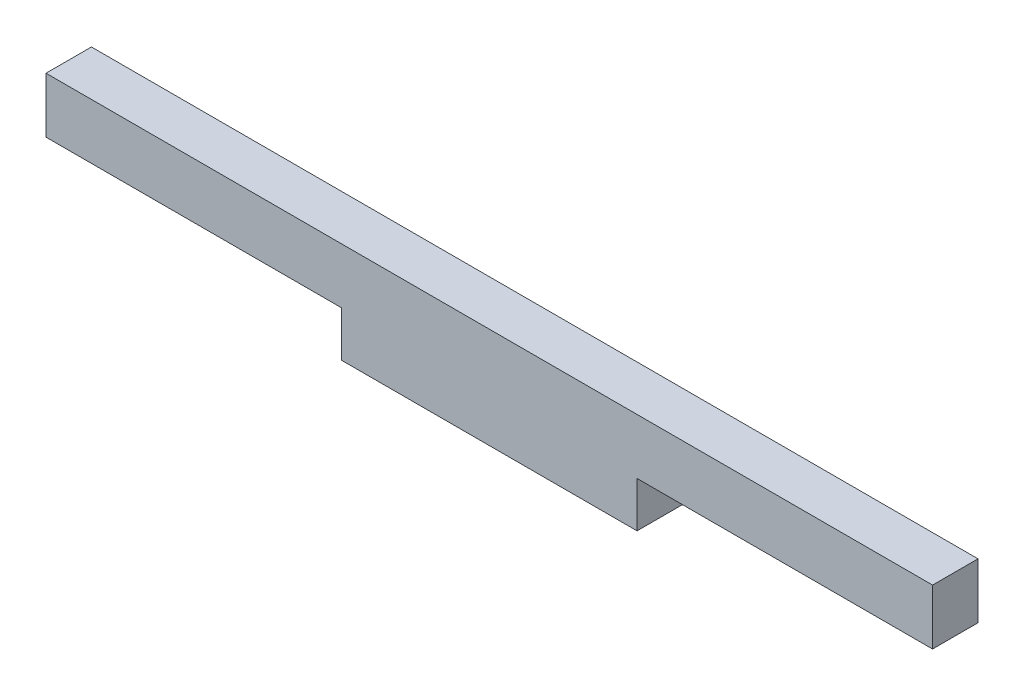
ISO-10303-21;
HEADER;
FILE_DESCRIPTION(('STEP AP214'),'2;1');
FILE_NAME('part.step','',(''),(''),'','','');
FILE_SCHEMA(('AUTOMOTIVE_DESIGN { 1 0 10303 214 1 1 1 1 }'));
ENDSEC;
DATA;
#1=APPLICATION_CONTEXT('core data for automotive mechanical design processes');
#2=APPLICATION_PROTOCOL_DEFINITION('international standard','automotive_design',2000,#1);
#3=PRODUCT_CONTEXT('',#1,'mechanical');
#4=PRODUCT('Part','Part','',(#3));
#5=PRODUCT_RELATED_PRODUCT_CATEGORY('part','',(#4));
#6=PRODUCT_DEFINITION_FORMATION('','',#4);
#7=PRODUCT_DEFINITION_CONTEXT('part definition',#1,'design');
#8=PRODUCT_DEFINITION('design','',#6,#7);
#9=PRODUCT_DEFINITION_SHAPE('','',#8);
#10=(LENGTH_UNIT() NAMED_UNIT(*) SI_UNIT(.MILLI.,.METRE.));
#11=(NAMED_UNIT(*) PLANE_ANGLE_UNIT() SI_UNIT($,.RADIAN.));
#12=(NAMED_UNIT(*) SI_UNIT($,.STERADIAN.) SOLID_ANGLE_UNIT());
#13=UNCERTAINTY_MEASURE_WITH_UNIT(LENGTH_MEASURE(1.E-05),#10,'distance_accuracy_value','');
#14=(GEOMETRIC_REPRESENTATION_CONTEXT(3) GLOBAL_UNCERTAINTY_ASSIGNED_CONTEXT((#13)) GLOBAL_UNIT_ASSIGNED_CONTEXT((#10,
#11,#12)) REPRESENTATION_CONTEXT('',''));
#15=CARTESIAN_POINT('',(0.,0.,0.));
#16=DIRECTION('',(0.,0.,1.));
#17=DIRECTION('',(1.,0.,0.));
#18=AXIS2_PLACEMENT_3D('',#15,#16,#17);
#19=CARTESIAN_POINT('',(0.,0.,5.207));
#20=DIRECTION('',(1.,0.,0.));
#21=DIRECTION('',(0.,0.,-1.));
#22=AXIS2_PLACEMENT_3D('',#19,#20,#21);
#23=PLANE('',#22);
#24=DIRECTION('',(0.,-1.,0.));
#25=VECTOR('',#24,1.);
#26=CARTESIAN_POINT('',(0.,0.,0.));
#27=LINE('',#26,#25);
#28=CARTESIAN_POINT('',(0.,6.35,0.));
#29=VERTEX_POINT('',#28);
#30=CARTESIAN_POINT('',(0.,0.,0.));
#31=VERTEX_POINT('',#30);
#32=EDGE_CURVE('E128',#29,#31,#27,.T.);
#33=ORIENTED_EDGE('',*,*,#32,.T.);
#34=DIRECTION('',(0.,0.,-1.));
#35=VECTOR('',#34,1.);
#36=CARTESIAN_POINT('',(0.,0.,5.207));
#37=LINE('',#36,#35);
#38=CARTESIAN_POINT('',(0.,0.,5.207));
#39=VERTEX_POINT('',#38);
#40=EDGE_CURVE('E11',#39,#31,#37,.T.);
#41=ORIENTED_EDGE('',*,*,#40,.F.);
#42=DIRECTION('',(0.,-1.,0.));
#43=VECTOR('',#42,1.);
#44=CARTESIAN_POINT('',(0.,0.,5.207));
#45=LINE('',#44,#43);
#46=CARTESIAN_POINT('',(0.,6.35,5.207));
#47=VERTEX_POINT('',#46);
#48=EDGE_CURVE('E142',#47,#39,#45,.T.);
#49=ORIENTED_EDGE('',*,*,#48,.F.);
#50=DIRECTION('',(0.,0.,-1.));
#51=VECTOR('',#50,1.);
#52=CARTESIAN_POINT('',(0.,6.35,5.207));
#53=LINE('',#52,#51);
#54=EDGE_CURVE('E124',#47,#29,#53,.T.);
#55=ORIENTED_EDGE('',*,*,#54,.T.);
#56=EDGE_LOOP('',(#33,#41,#49,#55));
#57=FACE_BOUND('',#56,.T.);
#58=ADVANCED_FACE('F32',(#57),#23,.F.);
#59=CARTESIAN_POINT('',(0.,0.,5.207));
#60=DIRECTION('',(0.,1.,0.));
#61=DIRECTION('',(0.,0.,1.));
#62=AXIS2_PLACEMENT_3D('',#59,#60,#61);
#63=PLANE('',#62);
#64=DIRECTION('',(1.,0.,0.));
#65=VECTOR('',#64,1.);
#66=CARTESIAN_POINT('',(0.,0.,0.));
#67=LINE('',#66,#65);
#68=CARTESIAN_POINT('',(33.8666666666667,0.,0.));
#69=VERTEX_POINT('',#68);
#70=EDGE_CURVE('E131',#31,#69,#67,.T.);
#71=ORIENTED_EDGE('',*,*,#70,.T.);
#72=DIRECTION('',(0.,0.,-1.));
#73=VECTOR('',#72,1.);
#74=CARTESIAN_POINT('',(33.8666666666667,0.,5.207));
#75=LINE('',#74,#73);
#76=CARTESIAN_POINT('',(33.8666666666667,0.,5.207));
#77=VERTEX_POINT('',#76);
#78=EDGE_CURVE('E40',#77,#69,#75,.T.);
#79=ORIENTED_EDGE('',*,*,#78,.F.);
#80=DIRECTION('',(1.,0.,0.));
#81=VECTOR('',#80,1.);
#82=CARTESIAN_POINT('',(0.,0.,5.207));
#83=LINE('',#82,#81);
#84=EDGE_CURVE('E91',#39,#77,#83,.T.);
#85=ORIENTED_EDGE('',*,*,#84,.F.);
#86=ORIENTED_EDGE('',*,*,#40,.T.);
#87=EDGE_LOOP('',(#71,#79,#85,#86));
#88=FACE_BOUND('',#87,.T.);
#89=ADVANCED_FACE('F177',(#88),#63,.F.);
#90=CARTESIAN_POINT('',(33.8666666666667,0.,5.207));
#91=DIRECTION('',(1.,0.,0.));
#92=DIRECTION('',(0.,1.,0.));
#93=AXIS2_PLACEMENT_3D('',#90,#91,#92);
#94=PLANE('',#93);
#95=DIRECTION('',(0.,-1.,0.));
#96=VECTOR('',#95,1.);
#97=CARTESIAN_POINT('',(33.8666666666667,0.,0.));
#98=LINE('',#97,#96);
#99=CARTESIAN_POINT('',(33.8666666666667,-5.207,0.));
#100=VERTEX_POINT('',#99);
#101=EDGE_CURVE('E133',#69,#100,#98,.T.);
#102=ORIENTED_EDGE('',*,*,#101,.T.);
#103=DIRECTION('',(0.,0.,-1.));
#104=VECTOR('',#103,1.);
#105=CARTESIAN_POINT('',(33.8666666666667,-5.207,5.207));
#106=LINE('',#105,#104);
#107=CARTESIAN_POINT('',(33.8666666666667,-5.207,5.207));
#108=VERTEX_POINT('',#107);
#109=EDGE_CURVE('E149',#108,#100,#106,.T.);
#110=ORIENTED_EDGE('',*,*,#109,.F.);
#111=DIRECTION('',(0.,-1.,0.));
#112=VECTOR('',#111,1.);
#113=CARTESIAN_POINT('',(33.8666666666667,0.,5.207));
#114=LINE('',#113,#112);
#115=EDGE_CURVE('E157',#77,#108,#114,.T.);
#116=ORIENTED_EDGE('',*,*,#115,.F.);
#117=ORIENTED_EDGE('',*,*,#78,.T.);
#118=EDGE_LOOP('',(#102,#110,#116,#117));
#119=FACE_BOUND('',#118,.T.);
#120=ADVANCED_FACE('F155',(#119),#94,.F.);
#121=CARTESIAN_POINT('',(33.8666666666667,-5.207,5.207));
#122=DIRECTION('',(0.,1.,0.));
#123=DIRECTION('',(0.,0.,1.));
#124=AXIS2_PLACEMENT_3D('',#121,#122,#123);
#125=PLANE('',#124);
#126=DIRECTION('',(1.,0.,0.));
#127=VECTOR('',#126,1.);
#128=CARTESIAN_POINT('',(33.8666666666667,-5.207,0.));
#129=LINE('',#128,#127);
#130=CARTESIAN_POINT('',(67.7333333333333,-5.207,0.));
#131=VERTEX_POINT('',#130);
#132=EDGE_CURVE('E135',#100,#131,#129,.T.);
#133=ORIENTED_EDGE('',*,*,#132,.T.);
#134=DIRECTION('',(0.,0.,-1.));
#135=VECTOR('',#134,1.);
#136=CARTESIAN_POINT('',(67.7333333333333,-5.207,5.207));
#137=LINE('',#136,#135);
#138=CARTESIAN_POINT('',(67.7333333333333,-5.207,5.207));
#139=VERTEX_POINT('',#138);
#140=EDGE_CURVE('E146',#139,#131,#137,.T.);
#141=ORIENTED_EDGE('',*,*,#140,.F.);
#142=DIRECTION('',(1.,0.,0.));
#143=VECTOR('',#142,1.);
#144=CARTESIAN_POINT('',(33.8666666666667,-5.207,5.207));
#145=LINE('',#144,#143);
#146=EDGE_CURVE('E169',#108,#139,#145,.T.);
#147=ORIENTED_EDGE('',*,*,#146,.F.);
#148=ORIENTED_EDGE('',*,*,#109,.T.);
#149=EDGE_LOOP('',(#133,#141,#147,#148));
#150=FACE_BOUND('',#149,.T.);
#151=ADVANCED_FACE('F165',(#150),#125,.F.);
#152=CARTESIAN_POINT('',(67.7333333333333,0.,5.207));
#153=DIRECTION('',(-1.,0.,0.));
#154=DIRECTION('',(0.,0.,1.));
#155=AXIS2_PLACEMENT_3D('',#152,#153,#154);
#156=PLANE('',#155);
#157=DIRECTION('',(0.,1.,0.));
#158=VECTOR('',#157,1.);
#159=CARTESIAN_POINT('',(67.7333333333333,0.,0.));
#160=LINE('',#159,#158);
#161=CARTESIAN_POINT('',(67.7333333333333,0.,0.));
#162=VERTEX_POINT('',#161);
#163=EDGE_CURVE('E137',#131,#162,#160,.T.);
#164=ORIENTED_EDGE('',*,*,#163,.T.);
#165=DIRECTION('',(0.,0.,-1.));
#166=VECTOR('',#165,1.);
#167=CARTESIAN_POINT('',(67.7333333333333,0.,5.207));
#168=LINE('',#167,#166);
#169=CARTESIAN_POINT('',(67.7333333333333,0.,5.207));
#170=VERTEX_POINT('',#169);
#171=EDGE_CURVE('E119',#170,#162,#168,.T.);
#172=ORIENTED_EDGE('',*,*,#171,.F.);
#173=DIRECTION('',(0.,1.,0.));
#174=VECTOR('',#173,1.);
#175=CARTESIAN_POINT('',(67.7333333333333,0.,5.207));
#176=LINE('',#175,#174);
#177=EDGE_CURVE('E110',#139,#170,#176,.T.);
#178=ORIENTED_EDGE('',*,*,#177,.F.);
#179=ORIENTED_EDGE('',*,*,#140,.T.);
#180=EDGE_LOOP('',(#164,#172,#178,#179));
#181=FACE_BOUND('',#180,.T.);
#182=ADVANCED_FACE('F168',(#181),#156,.F.);
#183=CARTESIAN_POINT('',(67.7333333333333,0.,5.207));
#184=DIRECTION('',(0.,1.,0.));
#185=DIRECTION('',(0.,0.,1.));
#186=AXIS2_PLACEMENT_3D('',#183,#184,#185);
#187=PLANE('',#186);
#188=DIRECTION('',(1.,0.,0.));
#189=VECTOR('',#188,1.);
#190=CARTESIAN_POINT('',(67.7333333333333,0.,0.));
#191=LINE('',#190,#189);
#192=CARTESIAN_POINT('',(101.6,0.,0.));
#193=VERTEX_POINT('',#192);
#194=EDGE_CURVE('E118',#162,#193,#191,.T.);
#195=ORIENTED_EDGE('',*,*,#194,.T.);
#196=DIRECTION('',(0.,0.,-1.));
#197=VECTOR('',#196,1.);
#198=CARTESIAN_POINT('',(101.6,0.,5.207));
#199=LINE('',#198,#197);
#200=CARTESIAN_POINT('',(101.6,0.,5.207));
#201=VERTEX_POINT('',#200);
#202=EDGE_CURVE('E115',#201,#193,#199,.T.);
#203=ORIENTED_EDGE('',*,*,#202,.F.);
#204=DIRECTION('',(1.,0.,0.));
#205=VECTOR('',#204,1.);
#206=CARTESIAN_POINT('',(67.7333333333333,0.,5.207));
#207=LINE('',#206,#205);
#208=EDGE_CURVE('E104',#170,#201,#207,.T.);
#209=ORIENTED_EDGE('',*,*,#208,.F.);
#210=ORIENTED_EDGE('',*,*,#171,.T.);
#211=EDGE_LOOP('',(#195,#203,#209,#210));
#212=FACE_BOUND('',#211,.T.);
#213=ADVANCED_FACE('F116',(#212),#187,.F.);
#214=CARTESIAN_POINT('',(101.6,0.,5.207));
#215=DIRECTION('',(-1.,0.,0.));
#216=DIRECTION('',(0.,0.,1.));
#217=AXIS2_PLACEMENT_3D('',#214,#215,#216);
#218=PLANE('',#217);
#219=DIRECTION('',(0.,1.,0.));
#220=VECTOR('',#219,1.);
#221=CARTESIAN_POINT('',(101.6,0.,0.));
#222=LINE('',#221,#220);
#223=CARTESIAN_POINT('',(101.6,6.35,0.));
#224=VERTEX_POINT('',#223);
#225=EDGE_CURVE('E77',#193,#224,#222,.T.);
#226=ORIENTED_EDGE('',*,*,#225,.T.);
#227=DIRECTION('',(0.,0.,-1.));
#228=VECTOR('',#227,1.);
#229=CARTESIAN_POINT('',(101.6,6.35,5.207));
#230=LINE('',#229,#228);
#231=CARTESIAN_POINT('',(101.6,6.35,5.207));
#232=VERTEX_POINT('',#231);
#233=EDGE_CURVE('E120',#232,#224,#230,.T.);
#234=ORIENTED_EDGE('',*,*,#233,.F.);
#235=DIRECTION('',(0.,1.,0.));
#236=VECTOR('',#235,1.);
#237=CARTESIAN_POINT('',(101.6,0.,5.207));
#238=LINE('',#237,#236);
#239=EDGE_CURVE('E108',#201,#232,#238,.T.);
#240=ORIENTED_EDGE('',*,*,#239,.F.);
#241=ORIENTED_EDGE('',*,*,#202,.T.);
#242=EDGE_LOOP('',(#226,#234,#240,#241));
#243=FACE_BOUND('',#242,.T.);
#244=ADVANCED_FACE('F122',(#243),#218,.F.);
#245=CARTESIAN_POINT('',(0.,6.35,5.207));
#246=DIRECTION('',(0.,-1.,0.));
#247=DIRECTION('',(0.,0.,-1.));
#248=AXIS2_PLACEMENT_3D('',#245,#246,#247);
#249=PLANE('',#248);
#250=DIRECTION('',(-1.,0.,0.));
#251=VECTOR('',#250,1.);
#252=CARTESIAN_POINT('',(0.,6.35,0.));
#253=LINE('',#252,#251);
#254=EDGE_CURVE('E83',#224,#29,#253,.T.);
#255=ORIENTED_EDGE('',*,*,#254,.T.);
#256=ORIENTED_EDGE('',*,*,#54,.F.);
#257=DIRECTION('',(-1.,0.,0.));
#258=VECTOR('',#257,1.);
#259=CARTESIAN_POINT('',(0.,6.35,5.207));
#260=LINE('',#259,#258);
#261=EDGE_CURVE('E48',#232,#47,#260,.T.);
#262=ORIENTED_EDGE('',*,*,#261,.F.);
#263=ORIENTED_EDGE('',*,*,#233,.T.);
#264=EDGE_LOOP('',(#255,#256,#262,#263));
#265=FACE_BOUND('',#264,.T.);
#266=ADVANCED_FACE('F193',(#265),#249,.F.);
#267=CARTESIAN_POINT('',(0.,0.,5.207));
#268=DIRECTION('',(0.,0.,-1.));
#269=DIRECTION('',(-1.,0.,0.));
#270=AXIS2_PLACEMENT_3D('',#267,#268,#269);
#271=PLANE('',#270);
#272=ORIENTED_EDGE('',*,*,#48,.T.);
#273=ORIENTED_EDGE('',*,*,#84,.T.);
#274=ORIENTED_EDGE('',*,*,#115,.T.);
#275=ORIENTED_EDGE('',*,*,#146,.T.);
#276=ORIENTED_EDGE('',*,*,#177,.T.);
#277=ORIENTED_EDGE('',*,*,#208,.T.);
#278=ORIENTED_EDGE('',*,*,#239,.T.);
#279=ORIENTED_EDGE('',*,*,#261,.T.);
#280=EDGE_LOOP('',(#272,#273,#274,#275,#276,#277,#278,#279));
#281=FACE_BOUND('',#280,.T.);
#282=ADVANCED_FACE('F106',(#281),#271,.F.);
#283=CARTESIAN_POINT('',(0.,0.,0.));
#284=DIRECTION('',(0.,0.,-1.));
#285=DIRECTION('',(-1.,0.,0.));
#286=AXIS2_PLACEMENT_3D('',#283,#284,#285);
#287=PLANE('',#286);
#288=ORIENTED_EDGE('',*,*,#32,.F.);
#289=ORIENTED_EDGE('',*,*,#254,.F.);
#290=ORIENTED_EDGE('',*,*,#225,.F.);
#291=ORIENTED_EDGE('',*,*,#194,.F.);
#292=ORIENTED_EDGE('',*,*,#163,.F.);
#293=ORIENTED_EDGE('',*,*,#132,.F.);
#294=ORIENTED_EDGE('',*,*,#101,.F.);
#295=ORIENTED_EDGE('',*,*,#70,.F.);
#296=EDGE_LOOP('',(#288,#289,#290,#291,#292,#293,#294,#295));
#297=FACE_BOUND('',#296,.T.);
#298=ADVANCED_FACE('F161',(#297),#287,.T.);
#299=CLOSED_SHELL('',(#58,#89,#120,#151,#182,#213,#244,#266,#282,#298));
#300=MANIFOLD_SOLID_BREP('B2',#299);
#301=ADVANCED_BREP_SHAPE_REPRESENTATION('',(#18,#300),#14);
#302=SHAPE_DEFINITION_REPRESENTATION(#9,#301);
ENDSEC;
END-ISO-10303-21;
